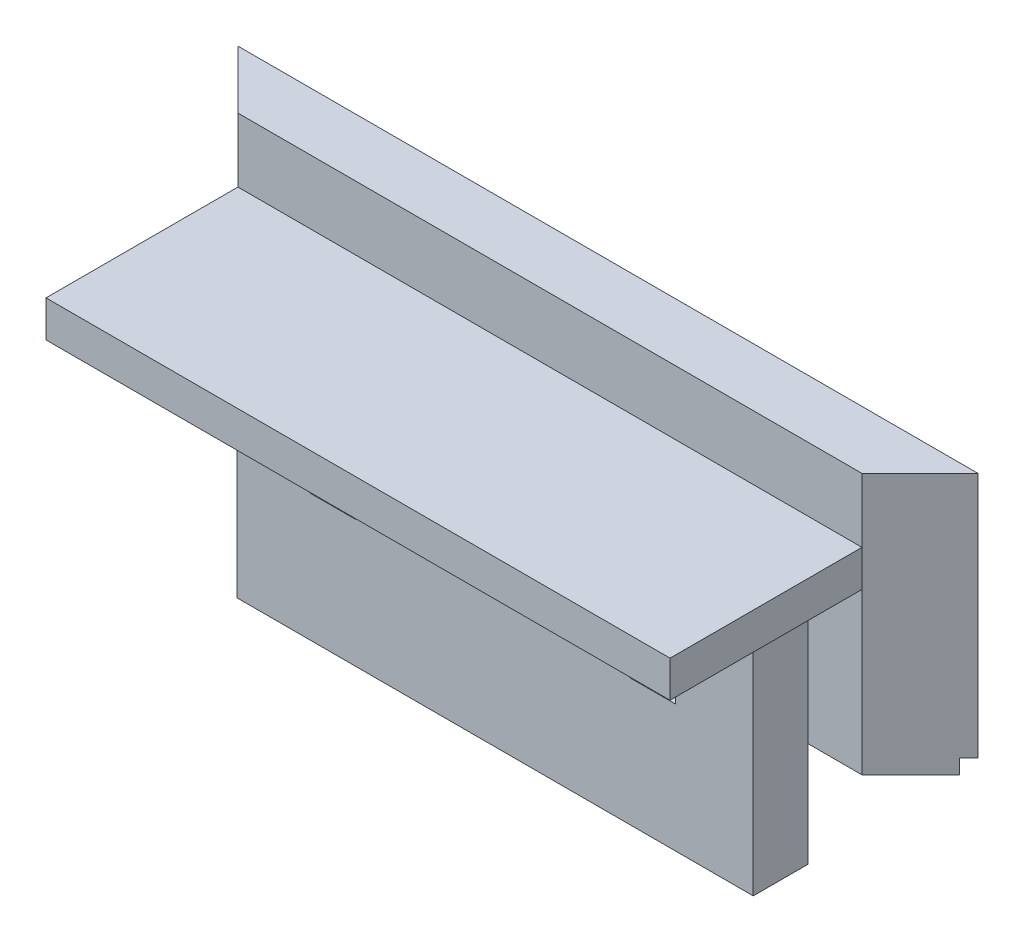
ISO-10303-21;
HEADER;
FILE_DESCRIPTION(('STEP AP214'),'2;1');
FILE_NAME('part.step','',(''),(''),'','','');
FILE_SCHEMA(('AUTOMOTIVE_DESIGN { 1 0 10303 214 1 1 1 1 }'));
ENDSEC;
DATA;
#1=APPLICATION_CONTEXT('core data for automotive mechanical design processes');
#2=APPLICATION_PROTOCOL_DEFINITION('international standard','automotive_design',2000,#1);
#3=PRODUCT_CONTEXT('',#1,'mechanical');
#4=PRODUCT('Part','Part','',(#3));
#5=PRODUCT_RELATED_PRODUCT_CATEGORY('part','',(#4));
#6=PRODUCT_DEFINITION_FORMATION('','',#4);
#7=PRODUCT_DEFINITION_CONTEXT('part definition',#1,'design');
#8=PRODUCT_DEFINITION('design','',#6,#7);
#9=PRODUCT_DEFINITION_SHAPE('','',#8);
#10=(LENGTH_UNIT() NAMED_UNIT(*) SI_UNIT(.MILLI.,.METRE.));
#11=(NAMED_UNIT(*) PLANE_ANGLE_UNIT() SI_UNIT($,.RADIAN.));
#12=(NAMED_UNIT(*) SI_UNIT($,.STERADIAN.) SOLID_ANGLE_UNIT());
#13=UNCERTAINTY_MEASURE_WITH_UNIT(LENGTH_MEASURE(1.E-05),#10,'distance_accuracy_value','');
#14=(GEOMETRIC_REPRESENTATION_CONTEXT(3) GLOBAL_UNCERTAINTY_ASSIGNED_CONTEXT((#13)) GLOBAL_UNIT_ASSIGNED_CONTEXT((#10,
#11,#12)) REPRESENTATION_CONTEXT('',''));
#15=CARTESIAN_POINT('',(0.,0.,0.));
#16=DIRECTION('',(0.,0.,1.));
#17=DIRECTION('',(1.,0.,0.));
#18=AXIS2_PLACEMENT_3D('',#15,#16,#17);
#19=CARTESIAN_POINT('',(-34.1503,28.575,6.35));
#20=DIRECTION('',(0.,0.,-1.));
#21=DIRECTION('',(-1.,0.,0.));
#22=AXIS2_PLACEMENT_3D('',#19,#20,#21);
#23=PLANE('',#22);
#24=DIRECTION('',(0.,1.,0.));
#25=VECTOR('',#24,1.);
#26=CARTESIAN_POINT('',(28.2448,-11.43,6.35));
#27=LINE('',#26,#25);
#28=CARTESIAN_POINT('',(28.2448,0.,6.35));
#29=VERTEX_POINT('',#28);
#30=CARTESIAN_POINT('',(28.2448,17.5768,6.35));
#31=VERTEX_POINT('',#30);
#32=EDGE_CURVE('E241',#29,#31,#27,.T.);
#33=ORIENTED_EDGE('',*,*,#32,.F.);
#34=DIRECTION('',(1.,0.,0.));
#35=VECTOR('',#34,1.);
#36=CARTESIAN_POINT('',(-34.1503,0.,6.35));
#37=LINE('',#36,#35);
#38=CARTESIAN_POINT('',(34.1503,0.,6.35));
#39=VERTEX_POINT('',#38);
#40=EDGE_CURVE('E419',#29,#39,#37,.T.);
#41=ORIENTED_EDGE('',*,*,#40,.T.);
#42=DIRECTION('',(0.,-1.,0.));
#43=VECTOR('',#42,1.);
#44=CARTESIAN_POINT('',(34.1503,28.575,6.35));
#45=LINE('',#44,#43);
#46=CARTESIAN_POINT('',(34.1503,17.5768,6.35));
#47=VERTEX_POINT('',#46);
#48=EDGE_CURVE('E411',#47,#39,#45,.T.);
#49=ORIENTED_EDGE('',*,*,#48,.F.);
#50=DIRECTION('',(1.,0.,0.));
#51=VECTOR('',#50,1.);
#52=CARTESIAN_POINT('',(-34.1503,17.5768,6.35));
#53=LINE('',#52,#51);
#54=EDGE_CURVE('E354',#31,#47,#53,.T.);
#55=ORIENTED_EDGE('',*,*,#54,.F.);
#56=EDGE_LOOP('',(#33,#41,#49,#55));
#57=FACE_BOUND('',#56,.T.);
#58=ADVANCED_FACE('F42',(#57),#23,.F.);
#59=DIRECTION('',(0.,-1.,0.));
#60=VECTOR('',#59,1.);
#61=CARTESIAN_POINT('',(-28.2448,-11.43,6.35));
#62=LINE('',#61,#60);
#63=CARTESIAN_POINT('',(-28.2448,17.5768,6.35));
#64=VERTEX_POINT('',#63);
#65=CARTESIAN_POINT('',(-28.2448,0.,6.35));
#66=VERTEX_POINT('',#65);
#67=EDGE_CURVE('E307',#64,#66,#62,.T.);
#68=ORIENTED_EDGE('',*,*,#67,.F.);
#69=CARTESIAN_POINT('',(-34.1503,17.5768,6.35));
#70=VERTEX_POINT('',#69);
#71=EDGE_CURVE('E355',#70,#64,#53,.T.);
#72=ORIENTED_EDGE('',*,*,#71,.F.);
#73=DIRECTION('',(0.,-1.,0.));
#74=VECTOR('',#73,1.);
#75=CARTESIAN_POINT('',(-34.1503,28.575,6.35));
#76=LINE('',#75,#74);
#77=CARTESIAN_POINT('',(-34.1503,0.,6.35));
#78=VERTEX_POINT('',#77);
#79=EDGE_CURVE('E427',#70,#78,#76,.T.);
#80=ORIENTED_EDGE('',*,*,#79,.T.);
#81=EDGE_CURVE('E402',#78,#66,#37,.T.);
#82=ORIENTED_EDGE('',*,*,#81,.T.);
#83=EDGE_LOOP('',(#68,#72,#80,#82));
#84=FACE_BOUND('',#83,.T.);
#85=ADVANCED_FACE('F456',(#84),#23,.F.);
#86=CARTESIAN_POINT('',(-34.1503,17.5768,27.3558));
#87=DIRECTION('',(0.,1.,0.));
#88=DIRECTION('',(0.,0.,1.));
#89=AXIS2_PLACEMENT_3D('',#86,#87,#88);
#90=PLANE('',#89);
#91=DIRECTION('',(0.,0.,-1.));
#92=VECTOR('',#91,1.);
#93=CARTESIAN_POINT('',(28.2448,17.5768,12.3444));
#94=LINE('',#93,#92);
#95=CARTESIAN_POINT('',(28.2448,17.5768,12.3444));
#96=VERTEX_POINT('',#95);
#97=EDGE_CURVE('E324',#96,#31,#94,.T.);
#98=ORIENTED_EDGE('',*,*,#97,.T.);
#99=ORIENTED_EDGE('',*,*,#54,.T.);
#100=DIRECTION('',(0.,0.,-1.));
#101=VECTOR('',#100,1.);
#102=CARTESIAN_POINT('',(34.1503,17.5768,27.3558));
#103=LINE('',#102,#101);
#104=CARTESIAN_POINT('',(34.1503,17.5768,27.3558));
#105=VERTEX_POINT('',#104);
#106=EDGE_CURVE('E365',#105,#47,#103,.T.);
#107=ORIENTED_EDGE('',*,*,#106,.F.);
#108=DIRECTION('',(1.,0.,0.));
#109=VECTOR('',#108,1.);
#110=CARTESIAN_POINT('',(-34.1503,17.5768,27.3558));
#111=LINE('',#110,#109);
#112=CARTESIAN_POINT('',(-34.1503,17.5768,27.3558));
#113=VERTEX_POINT('',#112);
#114=EDGE_CURVE('E340',#113,#105,#111,.T.);
#115=ORIENTED_EDGE('',*,*,#114,.F.);
#116=DIRECTION('',(0.,0.,-1.));
#117=VECTOR('',#116,1.);
#118=CARTESIAN_POINT('',(-34.1503,17.5768,27.3558));
#119=LINE('',#118,#117);
#120=EDGE_CURVE('E369',#113,#70,#119,.T.);
#121=ORIENTED_EDGE('',*,*,#120,.T.);
#122=ORIENTED_EDGE('',*,*,#71,.T.);
#123=DIRECTION('',(0.,0.,-1.));
#124=VECTOR('',#123,1.);
#125=CARTESIAN_POINT('',(-28.2448,17.5768,12.3444));
#126=LINE('',#125,#124);
#127=CARTESIAN_POINT('',(-28.2448,17.5768,12.3444));
#128=VERTEX_POINT('',#127);
#129=EDGE_CURVE('E320',#128,#64,#126,.T.);
#130=ORIENTED_EDGE('',*,*,#129,.F.);
#131=DIRECTION('',(-1.,0.,0.));
#132=VECTOR('',#131,1.);
#133=CARTESIAN_POINT('',(-28.2448,17.5768,12.3444));
#134=LINE('',#133,#132);
#135=CARTESIAN_POINT('',(-20.2438,17.5768,12.3444));
#136=VERTEX_POINT('',#135);
#137=EDGE_CURVE('E288',#136,#128,#134,.T.);
#138=ORIENTED_EDGE('',*,*,#137,.F.);
#139=DIRECTION('',(0.,0.,1.));
#140=VECTOR('',#139,1.);
#141=CARTESIAN_POINT('',(-20.2438,17.5768,6.35));
#142=LINE('',#141,#140);
#143=CARTESIAN_POINT('',(-20.2438,17.5768,6.35));
#144=VERTEX_POINT('',#143);
#145=EDGE_CURVE('E238',#144,#136,#142,.T.);
#146=ORIENTED_EDGE('',*,*,#145,.F.);
#147=DIRECTION('',(-1.,0.,0.));
#148=VECTOR('',#147,1.);
#149=CARTESIAN_POINT('',(-20.2438,17.5768,6.35));
#150=LINE('',#149,#148);
#151=CARTESIAN_POINT('',(-15.24,17.5768,6.35));
#152=VERTEX_POINT('',#151);
#153=EDGE_CURVE('E207',#152,#144,#150,.T.);
#154=ORIENTED_EDGE('',*,*,#153,.F.);
#155=DIRECTION('',(0.,0.,1.));
#156=VECTOR('',#155,1.);
#157=CARTESIAN_POINT('',(-15.24,17.5768,6.35));
#158=LINE('',#157,#156);
#159=CARTESIAN_POINT('',(-15.24,17.5768,12.3444));
#160=VERTEX_POINT('',#159);
#161=EDGE_CURVE('E242',#152,#160,#158,.T.);
#162=ORIENTED_EDGE('',*,*,#161,.T.);
#163=CARTESIAN_POINT('',(14.7574,17.5768,12.3444));
#164=VERTEX_POINT('',#163);
#165=EDGE_CURVE('E295',#164,#160,#134,.T.);
#166=ORIENTED_EDGE('',*,*,#165,.F.);
#167=DIRECTION('',(0.,0.,1.));
#168=VECTOR('',#167,1.);
#169=CARTESIAN_POINT('',(14.7574,17.5768,6.35));
#170=LINE('',#169,#168);
#171=CARTESIAN_POINT('',(14.7574,17.5768,6.35));
#172=VERTEX_POINT('',#171);
#173=EDGE_CURVE('E235',#172,#164,#170,.T.);
#174=ORIENTED_EDGE('',*,*,#173,.F.);
#175=DIRECTION('',(-1.,0.,0.));
#176=VECTOR('',#175,1.);
#177=CARTESIAN_POINT('',(14.7574,17.5768,6.35));
#178=LINE('',#177,#176);
#179=CARTESIAN_POINT('',(19.7612,17.5768,6.35));
#180=VERTEX_POINT('',#179);
#181=EDGE_CURVE('E260',#180,#172,#178,.T.);
#182=ORIENTED_EDGE('',*,*,#181,.F.);
#183=DIRECTION('',(0.,0.,1.));
#184=VECTOR('',#183,1.);
#185=CARTESIAN_POINT('',(19.7612,17.5768,6.35));
#186=LINE('',#185,#184);
#187=CARTESIAN_POINT('',(19.7612,17.5768,12.3444));
#188=VERTEX_POINT('',#187);
#189=EDGE_CURVE('E276',#180,#188,#186,.T.);
#190=ORIENTED_EDGE('',*,*,#189,.T.);
#191=EDGE_CURVE('E290',#96,#188,#134,.T.);
#192=ORIENTED_EDGE('',*,*,#191,.F.);
#193=EDGE_LOOP('',(#98,#99,#107,#115,#121,#122,#130,#138,#146,#154,#162,#166,#174,#182,#190,#192));
#194=FACE_BOUND('',#193,.T.);
#195=ADVANCED_FACE('F469',(#194),#90,.F.);
#196=DIRECTION('',(-1.,0.,0.));
#197=VECTOR('',#196,1.);
#198=CARTESIAN_POINT('',(34.1503,21.5646,6.35));
#199=LINE('',#198,#197);
#200=CARTESIAN_POINT('',(34.1503,21.5646,6.35));
#201=VERTEX_POINT('',#200);
#202=CARTESIAN_POINT('',(-34.1503,21.5646,6.35));
#203=VERTEX_POINT('',#202);
#204=EDGE_CURVE('E331',#201,#203,#199,.T.);
#205=ORIENTED_EDGE('',*,*,#204,.F.);
#206=CARTESIAN_POINT('',(34.1503,28.575,6.35));
#207=VERTEX_POINT('',#206);
#208=EDGE_CURVE('E423',#207,#201,#45,.T.);
#209=ORIENTED_EDGE('',*,*,#208,.F.);
#210=DIRECTION('',(1.,0.,0.));
#211=VECTOR('',#210,1.);
#212=CARTESIAN_POINT('',(-34.1503,28.575,6.35));
#213=LINE('',#212,#211);
#214=CARTESIAN_POINT('',(-34.1503,28.575,6.35));
#215=VERTEX_POINT('',#214);
#216=EDGE_CURVE('E408',#215,#207,#213,.T.);
#217=ORIENTED_EDGE('',*,*,#216,.F.);
#218=EDGE_CURVE('E428',#215,#203,#76,.T.);
#219=ORIENTED_EDGE('',*,*,#218,.T.);
#220=EDGE_LOOP('',(#205,#209,#217,#219));
#221=FACE_BOUND('',#220,.T.);
#222=ADVANCED_FACE('F483',(#221),#23,.F.);
#223=CARTESIAN_POINT('',(34.1503,28.575,6.35));
#224=DIRECTION('',(-0.707106781186548,0.,-0.707106781186547));
#225=DIRECTION('',(-0.707106781186547,0.,0.707106781186548));
#226=AXIS2_PLACEMENT_3D('',#223,#224,#225);
#227=PLANE('',#226);
#228=DIRECTION('',(0.707106781186547,0.,-0.707106781186548));
#229=VECTOR('',#228,1.);
#230=CARTESIAN_POINT('',(34.1503,0.,6.35));
#231=LINE('',#230,#229);
#232=CARTESIAN_POINT('',(39.49954,0.,1.00076));
#233=VERTEX_POINT('',#232);
#234=EDGE_CURVE('E396',#39,#233,#231,.T.);
#235=ORIENTED_EDGE('',*,*,#234,.T.);
#236=DIRECTION('',(0.,1.,0.));
#237=VECTOR('',#236,1.);
#238=CARTESIAN_POINT('',(39.49954,28.575,1.00076));
#239=LINE('',#238,#237);
#240=CARTESIAN_POINT('',(39.49954,1.5875,1.00076));
#241=VERTEX_POINT('',#240);
#242=EDGE_CURVE('E388',#233,#241,#239,.T.);
#243=ORIENTED_EDGE('',*,*,#242,.T.);
#244=DIRECTION('',(0.707106781186547,0.,-0.707106781186548));
#245=VECTOR('',#244,1.);
#246=CARTESIAN_POINT('',(34.1503,1.5875,6.34999999999999));
#247=LINE('',#246,#245);
#248=CARTESIAN_POINT('',(40.5003,1.5875,0.));
#249=VERTEX_POINT('',#248);
#250=EDGE_CURVE('E392',#241,#249,#247,.T.);
#251=ORIENTED_EDGE('',*,*,#250,.T.);
#252=DIRECTION('',(0.,-1.,0.));
#253=VECTOR('',#252,1.);
#254=CARTESIAN_POINT('',(40.5003,28.575,0.));
#255=LINE('',#254,#253);
#256=CARTESIAN_POINT('',(40.5003,28.575,0.));
#257=VERTEX_POINT('',#256);
#258=EDGE_CURVE('E436',#257,#249,#255,.T.);
#259=ORIENTED_EDGE('',*,*,#258,.F.);
#260=DIRECTION('',(0.707106781186547,0.,-0.707106781186548));
#261=VECTOR('',#260,1.);
#262=CARTESIAN_POINT('',(34.1503,28.575,6.35));
#263=LINE('',#262,#261);
#264=EDGE_CURVE('E397',#207,#257,#263,.T.);
#265=ORIENTED_EDGE('',*,*,#264,.F.);
#266=ORIENTED_EDGE('',*,*,#208,.T.);
#267=DIRECTION('',(0.,1.,0.));
#268=VECTOR('',#267,1.);
#269=CARTESIAN_POINT('',(34.1503,17.5768,6.35));
#270=LINE('',#269,#268);
#271=EDGE_CURVE('E337',#47,#201,#270,.T.);
#272=ORIENTED_EDGE('',*,*,#271,.F.);
#273=ORIENTED_EDGE('',*,*,#48,.T.);
#274=EDGE_LOOP('',(#235,#243,#251,#259,#265,#266,#272,#273));
#275=FACE_BOUND('',#274,.T.);
#276=ADVANCED_FACE('F44',(#275),#227,.F.);
#277=CARTESIAN_POINT('',(-40.5003,28.575,0.));
#278=DIRECTION('',(0.,0.,1.));
#279=DIRECTION('',(1.,0.,0.));
#280=AXIS2_PLACEMENT_3D('',#277,#278,#279);
#281=PLANE('',#280);
#282=ORIENTED_EDGE('',*,*,#258,.T.);
#283=DIRECTION('',(1.,0.,0.));
#284=VECTOR('',#283,1.);
#285=CARTESIAN_POINT('',(-40.5003,1.5875,0.));
#286=LINE('',#285,#284);
#287=CARTESIAN_POINT('',(-40.5003,1.5875,0.));
#288=VERTEX_POINT('',#287);
#289=EDGE_CURVE('E377',#288,#249,#286,.T.);
#290=ORIENTED_EDGE('',*,*,#289,.F.);
#291=DIRECTION('',(0.,-1.,0.));
#292=VECTOR('',#291,1.);
#293=CARTESIAN_POINT('',(-40.5003,28.575,0.));
#294=LINE('',#293,#292);
#295=CARTESIAN_POINT('',(-40.5003,28.575,0.));
#296=VERTEX_POINT('',#295);
#297=EDGE_CURVE('E432',#296,#288,#294,.T.);
#298=ORIENTED_EDGE('',*,*,#297,.F.);
#299=DIRECTION('',(-1.,0.,0.));
#300=VECTOR('',#299,1.);
#301=CARTESIAN_POINT('',(-40.5003,28.575,0.));
#302=LINE('',#301,#300);
#303=EDGE_CURVE('E401',#257,#296,#302,.T.);
#304=ORIENTED_EDGE('',*,*,#303,.F.);
#305=EDGE_LOOP('',(#282,#290,#298,#304));
#306=FACE_BOUND('',#305,.T.);
#307=ADVANCED_FACE('F567',(#306),#281,.F.);
#308=CARTESIAN_POINT('',(-40.5003,28.575,0.));
#309=DIRECTION('',(0.707106781186549,0.,-0.707106781186547));
#310=DIRECTION('',(-0.707106781186547,0.,-0.707106781186549));
#311=AXIS2_PLACEMENT_3D('',#308,#309,#310);
#312=PLANE('',#311);
#313=DIRECTION('',(0.707106781186547,0.,0.707106781186549));
#314=VECTOR('',#313,1.);
#315=CARTESIAN_POINT('',(-40.5003,1.5875,0.));
#316=LINE('',#315,#314);
#317=CARTESIAN_POINT('',(-39.49954,1.5875,1.00076));
#318=VERTEX_POINT('',#317);
#319=EDGE_CURVE('E11',#288,#318,#316,.T.);
#320=ORIENTED_EDGE('',*,*,#319,.T.);
#321=DIRECTION('',(0.,-1.,0.));
#322=VECTOR('',#321,1.);
#323=CARTESIAN_POINT('',(-39.49954,28.575,1.00076));
#324=LINE('',#323,#322);
#325=CARTESIAN_POINT('',(-39.49954,0.,1.00076));
#326=VERTEX_POINT('',#325);
#327=EDGE_CURVE('E382',#318,#326,#324,.T.);
#328=ORIENTED_EDGE('',*,*,#327,.T.);
#329=DIRECTION('',(0.707106781186546,0.,0.707106781186549));
#330=VECTOR('',#329,1.);
#331=CARTESIAN_POINT('',(-40.5003,0.,0.));
#332=LINE('',#331,#330);
#333=EDGE_CURVE('E415',#326,#78,#332,.T.);
#334=ORIENTED_EDGE('',*,*,#333,.T.);
#335=ORIENTED_EDGE('',*,*,#79,.F.);
#336=DIRECTION('',(0.,-1.,0.));
#337=VECTOR('',#336,1.);
#338=CARTESIAN_POINT('',(-34.1503,21.5646,6.35));
#339=LINE('',#338,#337);
#340=EDGE_CURVE('E350',#203,#70,#339,.T.);
#341=ORIENTED_EDGE('',*,*,#340,.F.);
#342=ORIENTED_EDGE('',*,*,#218,.F.);
#343=DIRECTION('',(0.707106781186546,0.,0.707106781186549));
#344=VECTOR('',#343,1.);
#345=CARTESIAN_POINT('',(-40.5003,28.575,0.));
#346=LINE('',#345,#344);
#347=EDGE_CURVE('E405',#296,#215,#346,.T.);
#348=ORIENTED_EDGE('',*,*,#347,.F.);
#349=ORIENTED_EDGE('',*,*,#297,.T.);
#350=EDGE_LOOP('',(#320,#328,#334,#335,#341,#342,#348,#349));
#351=FACE_BOUND('',#350,.T.);
#352=ADVANCED_FACE('F449',(#351),#312,.F.);
#353=CARTESIAN_POINT('',(0.,28.575,0.));
#354=DIRECTION('',(0.,-1.,0.));
#355=DIRECTION('',(0.,0.,-1.));
#356=AXIS2_PLACEMENT_3D('',#353,#354,#355);
#357=PLANE('',#356);
#358=ORIENTED_EDGE('',*,*,#264,.T.);
#359=ORIENTED_EDGE('',*,*,#303,.T.);
#360=ORIENTED_EDGE('',*,*,#347,.T.);
#361=ORIENTED_EDGE('',*,*,#216,.T.);
#362=EDGE_LOOP('',(#358,#359,#360,#361));
#363=FACE_BOUND('',#362,.T.);
#364=ADVANCED_FACE('F571',(#363),#357,.F.);
#365=CARTESIAN_POINT('',(0.,0.,0.));
#366=DIRECTION('',(0.,-1.,0.));
#367=DIRECTION('',(0.,0.,-1.));
#368=AXIS2_PLACEMENT_3D('',#365,#366,#367);
#369=PLANE('',#368);
#370=DIRECTION('',(-1.,0.,0.));
#371=VECTOR('',#370,1.);
#372=CARTESIAN_POINT('',(0.,0.,1.00076));
#373=LINE('',#372,#371);
#374=EDGE_CURVE('E51',#233,#326,#373,.T.);
#375=ORIENTED_EDGE('',*,*,#374,.F.);
#376=ORIENTED_EDGE('',*,*,#234,.F.);
#377=ORIENTED_EDGE('',*,*,#40,.F.);
#378=DIRECTION('',(1.,0.,0.));
#379=VECTOR('',#378,1.);
#380=CARTESIAN_POINT('',(0.,0.,6.35));
#381=LINE('',#380,#379);
#382=EDGE_CURVE('E327',#66,#29,#381,.T.);
#383=ORIENTED_EDGE('',*,*,#382,.F.);
#384=ORIENTED_EDGE('',*,*,#81,.F.);
#385=ORIENTED_EDGE('',*,*,#333,.F.);
#386=EDGE_LOOP('',(#375,#376,#377,#383,#384,#385));
#387=FACE_BOUND('',#386,.T.);
#388=ADVANCED_FACE('F452',(#387),#369,.T.);
#389=CARTESIAN_POINT('',(-40.5003,1.5875,0.));
#390=DIRECTION('',(0.,1.,0.));
#391=DIRECTION('',(0.,0.,1.));
#392=AXIS2_PLACEMENT_3D('',#389,#390,#391);
#393=PLANE('',#392);
#394=DIRECTION('',(1.,0.,0.));
#395=VECTOR('',#394,1.);
#396=CARTESIAN_POINT('',(-40.5003,1.5875,1.00076));
#397=LINE('',#396,#395);
#398=EDGE_CURVE('E378',#318,#241,#397,.T.);
#399=ORIENTED_EDGE('',*,*,#398,.F.);
#400=ORIENTED_EDGE('',*,*,#319,.F.);
#401=ORIENTED_EDGE('',*,*,#289,.T.);
#402=ORIENTED_EDGE('',*,*,#250,.F.);
#403=EDGE_LOOP('',(#399,#400,#401,#402));
#404=FACE_BOUND('',#403,.T.);
#405=ADVANCED_FACE('F578',(#404),#393,.F.);
#406=CARTESIAN_POINT('',(-40.5003,1.5875,1.00076));
#407=DIRECTION('',(0.,0.,1.));
#408=DIRECTION('',(0.,-1.,0.));
#409=AXIS2_PLACEMENT_3D('',#406,#407,#408);
#410=PLANE('',#409);
#411=ORIENTED_EDGE('',*,*,#374,.T.);
#412=ORIENTED_EDGE('',*,*,#327,.F.);
#413=ORIENTED_EDGE('',*,*,#398,.T.);
#414=ORIENTED_EDGE('',*,*,#242,.F.);
#415=EDGE_LOOP('',(#411,#412,#413,#414));
#416=FACE_BOUND('',#415,.T.);
#417=ADVANCED_FACE('F443',(#416),#410,.F.);
#418=CARTESIAN_POINT('',(34.1503,21.5646,27.3558));
#419=DIRECTION('',(0.,-1.,0.));
#420=DIRECTION('',(1.,0.,0.));
#421=AXIS2_PLACEMENT_3D('',#418,#419,#420);
#422=PLANE('',#421);
#423=ORIENTED_EDGE('',*,*,#204,.T.);
#424=DIRECTION('',(0.,0.,-1.));
#425=VECTOR('',#424,1.);
#426=CARTESIAN_POINT('',(-34.1503,21.5646,27.3558));
#427=LINE('',#426,#425);
#428=CARTESIAN_POINT('',(-34.1503,21.5646,27.3558));
#429=VERTEX_POINT('',#428);
#430=EDGE_CURVE('E373',#429,#203,#427,.T.);
#431=ORIENTED_EDGE('',*,*,#430,.F.);
#432=DIRECTION('',(-1.,0.,0.));
#433=VECTOR('',#432,1.);
#434=CARTESIAN_POINT('',(34.1503,21.5646,27.3558));
#435=LINE('',#434,#433);
#436=CARTESIAN_POINT('',(34.1503,21.5646,27.3558));
#437=VERTEX_POINT('',#436);
#438=EDGE_CURVE('E332',#437,#429,#435,.T.);
#439=ORIENTED_EDGE('',*,*,#438,.F.);
#440=DIRECTION('',(0.,0.,-1.));
#441=VECTOR('',#440,1.);
#442=CARTESIAN_POINT('',(34.1503,21.5646,27.3558));
#443=LINE('',#442,#441);
#444=EDGE_CURVE('E346',#437,#201,#443,.T.);
#445=ORIENTED_EDGE('',*,*,#444,.T.);
#446=EDGE_LOOP('',(#423,#431,#439,#445));
#447=FACE_BOUND('',#446,.T.);
#448=ADVANCED_FACE('F479',(#447),#422,.F.);
#449=CARTESIAN_POINT('',(-34.1503,21.5646,27.3558));
#450=DIRECTION('',(1.,0.,0.));
#451=DIRECTION('',(0.,0.,-1.));
#452=AXIS2_PLACEMENT_3D('',#449,#450,#451);
#453=PLANE('',#452);
#454=ORIENTED_EDGE('',*,*,#340,.T.);
#455=ORIENTED_EDGE('',*,*,#120,.F.);
#456=DIRECTION('',(0.,-1.,0.));
#457=VECTOR('',#456,1.);
#458=CARTESIAN_POINT('',(-34.1503,21.5646,27.3558));
#459=LINE('',#458,#457);
#460=EDGE_CURVE('E336',#429,#113,#459,.T.);
#461=ORIENTED_EDGE('',*,*,#460,.F.);
#462=ORIENTED_EDGE('',*,*,#430,.T.);
#463=EDGE_LOOP('',(#454,#455,#461,#462));
#464=FACE_BOUND('',#463,.T.);
#465=ADVANCED_FACE('F475',(#464),#453,.F.);
#466=CARTESIAN_POINT('',(34.1503,17.5768,27.3558));
#467=DIRECTION('',(-1.,0.,0.));
#468=DIRECTION('',(0.,0.,1.));
#469=AXIS2_PLACEMENT_3D('',#466,#467,#468);
#470=PLANE('',#469);
#471=ORIENTED_EDGE('',*,*,#271,.T.);
#472=ORIENTED_EDGE('',*,*,#444,.F.);
#473=DIRECTION('',(0.,1.,0.));
#474=VECTOR('',#473,1.);
#475=CARTESIAN_POINT('',(34.1503,17.5768,27.3558));
#476=LINE('',#475,#474);
#477=EDGE_CURVE('E343',#105,#437,#476,.T.);
#478=ORIENTED_EDGE('',*,*,#477,.F.);
#479=ORIENTED_EDGE('',*,*,#106,.T.);
#480=EDGE_LOOP('',(#471,#472,#478,#479));
#481=FACE_BOUND('',#480,.T.);
#482=ADVANCED_FACE('F492',(#481),#470,.F.);
#483=CARTESIAN_POINT('',(0.,0.,27.3558));
#484=DIRECTION('',(0.,0.,1.));
#485=DIRECTION('',(1.,0.,0.));
#486=AXIS2_PLACEMENT_3D('',#483,#484,#485);
#487=PLANE('',#486);
#488=ORIENTED_EDGE('',*,*,#438,.T.);
#489=ORIENTED_EDGE('',*,*,#460,.T.);
#490=ORIENTED_EDGE('',*,*,#114,.T.);
#491=ORIENTED_EDGE('',*,*,#477,.T.);
#492=EDGE_LOOP('',(#488,#489,#490,#491));
#493=FACE_BOUND('',#492,.T.);
#494=ADVANCED_FACE('F626',(#493),#487,.T.);
#495=CARTESIAN_POINT('',(28.2448,-11.43,12.3444));
#496=DIRECTION('',(-1.,0.,0.));
#497=DIRECTION('',(0.,0.,1.));
#498=AXIS2_PLACEMENT_3D('',#495,#496,#497);
#499=PLANE('',#498);
#500=CARTESIAN_POINT('',(28.2448,-11.43,6.35));
#501=VERTEX_POINT('',#500);
#502=EDGE_CURVE('E302',#501,#29,#27,.T.);
#503=ORIENTED_EDGE('',*,*,#502,.T.);
#504=ORIENTED_EDGE('',*,*,#32,.T.);
#505=ORIENTED_EDGE('',*,*,#97,.F.);
#506=DIRECTION('',(0.,1.,0.));
#507=VECTOR('',#506,1.);
#508=CARTESIAN_POINT('',(28.2448,-11.43,12.3444));
#509=LINE('',#508,#507);
#510=CARTESIAN_POINT('',(28.2448,-11.43,12.3444));
#511=VERTEX_POINT('',#510);
#512=EDGE_CURVE('E284',#511,#96,#509,.T.);
#513=ORIENTED_EDGE('',*,*,#512,.F.);
#514=DIRECTION('',(0.,0.,-1.));
#515=VECTOR('',#514,1.);
#516=CARTESIAN_POINT('',(28.2448,-11.43,12.3444));
#517=LINE('',#516,#515);
#518=EDGE_CURVE('E301',#511,#501,#517,.T.);
#519=ORIENTED_EDGE('',*,*,#518,.T.);
#520=EDGE_LOOP('',(#503,#504,#505,#513,#519));
#521=FACE_BOUND('',#520,.T.);
#522=ADVANCED_FACE('F532',(#521),#499,.F.);
#523=CARTESIAN_POINT('',(-28.2448,-11.43,12.3444));
#524=DIRECTION('',(1.,0.,0.));
#525=DIRECTION('',(0.,0.,-1.));
#526=AXIS2_PLACEMENT_3D('',#523,#524,#525);
#527=PLANE('',#526);
#528=ORIENTED_EDGE('',*,*,#67,.T.);
#529=CARTESIAN_POINT('',(-28.2448,-11.43,6.35));
#530=VERTEX_POINT('',#529);
#531=EDGE_CURVE('E306',#66,#530,#62,.T.);
#532=ORIENTED_EDGE('',*,*,#531,.T.);
#533=DIRECTION('',(0.,0.,-1.));
#534=VECTOR('',#533,1.);
#535=CARTESIAN_POINT('',(-28.2448,-11.43,12.3444));
#536=LINE('',#535,#534);
#537=CARTESIAN_POINT('',(-28.2448,-11.43,12.3444));
#538=VERTEX_POINT('',#537);
#539=EDGE_CURVE('E316',#538,#530,#536,.T.);
#540=ORIENTED_EDGE('',*,*,#539,.F.);
#541=DIRECTION('',(0.,-1.,0.));
#542=VECTOR('',#541,1.);
#543=CARTESIAN_POINT('',(-28.2448,-11.43,12.3444));
#544=LINE('',#543,#542);
#545=EDGE_CURVE('E294',#128,#538,#544,.T.);
#546=ORIENTED_EDGE('',*,*,#545,.F.);
#547=ORIENTED_EDGE('',*,*,#129,.T.);
#548=EDGE_LOOP('',(#528,#532,#540,#546,#547));
#549=FACE_BOUND('',#548,.T.);
#550=ADVANCED_FACE('F464',(#549),#527,.F.);
#551=CARTESIAN_POINT('',(-28.2448,-11.43,12.3444));
#552=DIRECTION('',(0.,1.,0.));
#553=DIRECTION('',(0.,0.,1.));
#554=AXIS2_PLACEMENT_3D('',#551,#552,#553);
#555=PLANE('',#554);
#556=DIRECTION('',(1.,0.,0.));
#557=VECTOR('',#556,1.);
#558=CARTESIAN_POINT('',(-28.2448,-11.43,6.35));
#559=LINE('',#558,#557);
#560=EDGE_CURVE('E289',#530,#501,#559,.T.);
#561=ORIENTED_EDGE('',*,*,#560,.T.);
#562=ORIENTED_EDGE('',*,*,#518,.F.);
#563=DIRECTION('',(1.,0.,0.));
#564=VECTOR('',#563,1.);
#565=CARTESIAN_POINT('',(-28.2448,-11.43,12.3444));
#566=LINE('',#565,#564);
#567=EDGE_CURVE('E298',#538,#511,#566,.T.);
#568=ORIENTED_EDGE('',*,*,#567,.F.);
#569=ORIENTED_EDGE('',*,*,#539,.T.);
#570=EDGE_LOOP('',(#561,#562,#568,#569));
#571=FACE_BOUND('',#570,.T.);
#572=ADVANCED_FACE('F644',(#571),#555,.F.);
#573=CARTESIAN_POINT('',(0.,0.,12.3444));
#574=DIRECTION('',(0.,0.,-1.));
#575=DIRECTION('',(-1.,0.,0.));
#576=AXIS2_PLACEMENT_3D('',#573,#574,#575);
#577=PLANE('',#576);
#578=DIRECTION('',(1.,0.,0.));
#579=VECTOR('',#578,1.);
#580=CARTESIAN_POINT('',(-20.2438,2.49936,12.3444));
#581=LINE('',#580,#579);
#582=CARTESIAN_POINT('',(-20.2438,2.49936,12.3444));
#583=VERTEX_POINT('',#582);
#584=CARTESIAN_POINT('',(-15.24,2.49936,12.3444));
#585=VERTEX_POINT('',#584);
#586=EDGE_CURVE('E226',#583,#585,#581,.T.);
#587=ORIENTED_EDGE('',*,*,#586,.F.);
#588=DIRECTION('',(0.,-1.,0.));
#589=VECTOR('',#588,1.);
#590=CARTESIAN_POINT('',(-20.2438,17.5768,12.3444));
#591=LINE('',#590,#589);
#592=EDGE_CURVE('E58',#136,#583,#591,.T.);
#593=ORIENTED_EDGE('',*,*,#592,.F.);
#594=ORIENTED_EDGE('',*,*,#137,.T.);
#595=ORIENTED_EDGE('',*,*,#545,.T.);
#596=ORIENTED_EDGE('',*,*,#567,.T.);
#597=ORIENTED_EDGE('',*,*,#512,.T.);
#598=ORIENTED_EDGE('',*,*,#191,.T.);
#599=DIRECTION('',(0.,1.,0.));
#600=VECTOR('',#599,1.);
#601=CARTESIAN_POINT('',(19.7612,17.5768,12.3444));
#602=LINE('',#601,#600);
#603=CARTESIAN_POINT('',(19.7612,2.49936,12.3444));
#604=VERTEX_POINT('',#603);
#605=EDGE_CURVE('E252',#604,#188,#602,.T.);
#606=ORIENTED_EDGE('',*,*,#605,.F.);
#607=DIRECTION('',(1.,0.,0.));
#608=VECTOR('',#607,1.);
#609=CARTESIAN_POINT('',(14.7574,2.49936,12.3444));
#610=LINE('',#609,#608);
#611=CARTESIAN_POINT('',(14.7574,2.49936,12.3444));
#612=VERTEX_POINT('',#611);
#613=EDGE_CURVE('E267',#612,#604,#610,.T.);
#614=ORIENTED_EDGE('',*,*,#613,.F.);
#615=DIRECTION('',(0.,-1.,0.));
#616=VECTOR('',#615,1.);
#617=CARTESIAN_POINT('',(14.7574,17.5768,12.3444));
#618=LINE('',#617,#616);
#619=EDGE_CURVE('E66',#164,#612,#618,.T.);
#620=ORIENTED_EDGE('',*,*,#619,.F.);
#621=ORIENTED_EDGE('',*,*,#165,.T.);
#622=DIRECTION('',(0.,1.,0.));
#623=VECTOR('',#622,1.);
#624=CARTESIAN_POINT('',(-15.24,17.5768,12.3444));
#625=LINE('',#624,#623);
#626=EDGE_CURVE('E221',#585,#160,#625,.T.);
#627=ORIENTED_EDGE('',*,*,#626,.F.);
#628=EDGE_LOOP('',(#587,#593,#594,#595,#596,#597,#598,#606,#614,#620,#621,#627));
#629=FACE_BOUND('',#628,.T.);
#630=ADVANCED_FACE('F651',(#629),#577,.F.);
#631=CARTESIAN_POINT('',(0.,0.,6.35));
#632=DIRECTION('',(0.,0.,-1.));
#633=DIRECTION('',(-1.,0.,0.));
#634=AXIS2_PLACEMENT_3D('',#631,#632,#633);
#635=PLANE('',#634);
#636=ORIENTED_EDGE('',*,*,#531,.F.);
#637=ORIENTED_EDGE('',*,*,#382,.T.);
#638=ORIENTED_EDGE('',*,*,#502,.F.);
#639=ORIENTED_EDGE('',*,*,#560,.F.);
#640=EDGE_LOOP('',(#636,#637,#638,#639));
#641=FACE_BOUND('',#640,.T.);
#642=ADVANCED_FACE('F459',(#641),#635,.T.);
#643=CARTESIAN_POINT('',(14.7574,17.5768,6.35));
#644=DIRECTION('',(-1.,0.,0.));
#645=DIRECTION('',(0.,-1.,0.));
#646=AXIS2_PLACEMENT_3D('',#643,#644,#645);
#647=PLANE('',#646);
#648=ORIENTED_EDGE('',*,*,#619,.T.);
#649=DIRECTION('',(0.,0.,1.));
#650=VECTOR('',#649,1.);
#651=CARTESIAN_POINT('',(14.7574,2.49936,6.35));
#652=LINE('',#651,#650);
#653=CARTESIAN_POINT('',(14.7574,2.49936,6.35));
#654=VERTEX_POINT('',#653);
#655=EDGE_CURVE('E264',#654,#612,#652,.T.);
#656=ORIENTED_EDGE('',*,*,#655,.F.);
#657=DIRECTION('',(0.,-1.,0.));
#658=VECTOR('',#657,1.);
#659=CARTESIAN_POINT('',(14.7574,17.5768,6.35));
#660=LINE('',#659,#658);
#661=EDGE_CURVE('E247',#172,#654,#660,.T.);
#662=ORIENTED_EDGE('',*,*,#661,.F.);
#663=ORIENTED_EDGE('',*,*,#173,.T.);
#664=EDGE_LOOP('',(#648,#656,#662,#663));
#665=FACE_BOUND('',#664,.T.);
#666=ADVANCED_FACE('F666',(#665),#647,.F.);
#667=CARTESIAN_POINT('',(19.7612,17.5768,6.35));
#668=DIRECTION('',(1.,0.,0.));
#669=DIRECTION('',(0.,1.,0.));
#670=AXIS2_PLACEMENT_3D('',#667,#668,#669);
#671=PLANE('',#670);
#672=ORIENTED_EDGE('',*,*,#605,.T.);
#673=ORIENTED_EDGE('',*,*,#189,.F.);
#674=DIRECTION('',(0.,1.,0.));
#675=VECTOR('',#674,1.);
#676=CARTESIAN_POINT('',(19.7612,17.5768,6.35));
#677=LINE('',#676,#675);
#678=CARTESIAN_POINT('',(19.7612,2.49936,6.35));
#679=VERTEX_POINT('',#678);
#680=EDGE_CURVE('E256',#679,#180,#677,.T.);
#681=ORIENTED_EDGE('',*,*,#680,.F.);
#682=DIRECTION('',(0.,0.,1.));
#683=VECTOR('',#682,1.);
#684=CARTESIAN_POINT('',(19.7612,2.49936,6.35));
#685=LINE('',#684,#683);
#686=EDGE_CURVE('E279',#679,#604,#685,.T.);
#687=ORIENTED_EDGE('',*,*,#686,.T.);
#688=EDGE_LOOP('',(#672,#673,#681,#687));
#689=FACE_BOUND('',#688,.T.);
#690=ADVANCED_FACE('F673',(#689),#671,.F.);
#691=CARTESIAN_POINT('',(14.7574,2.49936,6.35));
#692=DIRECTION('',(0.,-1.,0.));
#693=DIRECTION('',(0.,0.,-1.));
#694=AXIS2_PLACEMENT_3D('',#691,#692,#693);
#695=PLANE('',#694);
#696=ORIENTED_EDGE('',*,*,#613,.T.);
#697=ORIENTED_EDGE('',*,*,#686,.F.);
#698=DIRECTION('',(1.,0.,0.));
#699=VECTOR('',#698,1.);
#700=CARTESIAN_POINT('',(14.7574,2.49936,6.35));
#701=LINE('',#700,#699);
#702=EDGE_CURVE('E251',#654,#679,#701,.T.);
#703=ORIENTED_EDGE('',*,*,#702,.F.);
#704=ORIENTED_EDGE('',*,*,#655,.T.);
#705=EDGE_LOOP('',(#696,#697,#703,#704));
#706=FACE_BOUND('',#705,.T.);
#707=ADVANCED_FACE('F680',(#706),#695,.F.);
#708=CARTESIAN_POINT('',(0.,0.,6.35));
#709=DIRECTION('',(0.,0.,1.));
#710=DIRECTION('',(1.,0.,0.));
#711=AXIS2_PLACEMENT_3D('',#708,#709,#710);
#712=PLANE('',#711);
#713=ORIENTED_EDGE('',*,*,#661,.T.);
#714=ORIENTED_EDGE('',*,*,#702,.T.);
#715=ORIENTED_EDGE('',*,*,#680,.T.);
#716=ORIENTED_EDGE('',*,*,#181,.T.);
#717=EDGE_LOOP('',(#713,#714,#715,#716));
#718=FACE_BOUND('',#717,.T.);
#719=ADVANCED_FACE('F688',(#718),#712,.T.);
#720=CARTESIAN_POINT('',(-20.2438,17.5768,6.35));
#721=DIRECTION('',(-1.,0.,0.));
#722=DIRECTION('',(0.,-1.,0.));
#723=AXIS2_PLACEMENT_3D('',#720,#721,#722);
#724=PLANE('',#723);
#725=ORIENTED_EDGE('',*,*,#592,.T.);
#726=DIRECTION('',(0.,0.,1.));
#727=VECTOR('',#726,1.);
#728=CARTESIAN_POINT('',(-20.2438,2.49936,6.35));
#729=LINE('',#728,#727);
#730=CARTESIAN_POINT('',(-20.2438,2.49936,6.35));
#731=VERTEX_POINT('',#730);
#732=EDGE_CURVE('E196',#731,#583,#729,.T.);
#733=ORIENTED_EDGE('',*,*,#732,.F.);
#734=DIRECTION('',(0.,-1.,0.));
#735=VECTOR('',#734,1.);
#736=CARTESIAN_POINT('',(-20.2438,17.5768,6.35));
#737=LINE('',#736,#735);
#738=EDGE_CURVE('E200',#144,#731,#737,.T.);
#739=ORIENTED_EDGE('',*,*,#738,.F.);
#740=ORIENTED_EDGE('',*,*,#145,.T.);
#741=EDGE_LOOP('',(#725,#733,#739,#740));
#742=FACE_BOUND('',#741,.T.);
#743=ADVANCED_FACE('F198',(#742),#724,.F.);
#744=CARTESIAN_POINT('',(-15.24,17.5768,6.35));
#745=DIRECTION('',(1.,0.,0.));
#746=DIRECTION('',(0.,1.,0.));
#747=AXIS2_PLACEMENT_3D('',#744,#745,#746);
#748=PLANE('',#747);
#749=ORIENTED_EDGE('',*,*,#626,.T.);
#750=ORIENTED_EDGE('',*,*,#161,.F.);
#751=DIRECTION('',(0.,1.,0.));
#752=VECTOR('',#751,1.);
#753=CARTESIAN_POINT('',(-15.24,17.5768,6.35));
#754=LINE('',#753,#752);
#755=CARTESIAN_POINT('',(-15.24,2.49936,6.35));
#756=VERTEX_POINT('',#755);
#757=EDGE_CURVE('E216',#756,#152,#754,.T.);
#758=ORIENTED_EDGE('',*,*,#757,.F.);
#759=DIRECTION('',(0.,0.,1.));
#760=VECTOR('',#759,1.);
#761=CARTESIAN_POINT('',(-15.24,2.49936,6.35));
#762=LINE('',#761,#760);
#763=EDGE_CURVE('E206',#756,#585,#762,.T.);
#764=ORIENTED_EDGE('',*,*,#763,.T.);
#765=EDGE_LOOP('',(#749,#750,#758,#764));
#766=FACE_BOUND('',#765,.T.);
#767=ADVANCED_FACE('F703',(#766),#748,.F.);
#768=CARTESIAN_POINT('',(-20.2438,2.49936,6.35));
#769=DIRECTION('',(0.,-1.,0.));
#770=DIRECTION('',(0.,0.,-1.));
#771=AXIS2_PLACEMENT_3D('',#768,#769,#770);
#772=PLANE('',#771);
#773=ORIENTED_EDGE('',*,*,#586,.T.);
#774=ORIENTED_EDGE('',*,*,#763,.F.);
#775=DIRECTION('',(1.,0.,0.));
#776=VECTOR('',#775,1.);
#777=CARTESIAN_POINT('',(-20.2438,2.49936,6.35));
#778=LINE('',#777,#776);
#779=EDGE_CURVE('E210',#731,#756,#778,.T.);
#780=ORIENTED_EDGE('',*,*,#779,.F.);
#781=ORIENTED_EDGE('',*,*,#732,.T.);
#782=EDGE_LOOP('',(#773,#774,#780,#781));
#783=FACE_BOUND('',#782,.T.);
#784=ADVANCED_FACE('F211',(#783),#772,.F.);
#785=CARTESIAN_POINT('',(0.,0.,6.35));
#786=DIRECTION('',(0.,0.,1.));
#787=DIRECTION('',(1.,0.,0.));
#788=AXIS2_PLACEMENT_3D('',#785,#786,#787);
#789=PLANE('',#788);
#790=ORIENTED_EDGE('',*,*,#738,.T.);
#791=ORIENTED_EDGE('',*,*,#779,.T.);
#792=ORIENTED_EDGE('',*,*,#757,.T.);
#793=ORIENTED_EDGE('',*,*,#153,.T.);
#794=EDGE_LOOP('',(#790,#791,#792,#793));
#795=FACE_BOUND('',#794,.T.);
#796=ADVANCED_FACE('F218',(#795),#789,.T.);
#797=CLOSED_SHELL('',(#58,#85,#195,#222,#276,#307,#352,#364,#388,#405,#417,#448,#465,#482,#494,
#522,#550,#572,#630,#642,#666,#690,#707,#719,#743,#767,#784,#796));
#798=MANIFOLD_SOLID_BREP('B2',#797);
#799=ADVANCED_BREP_SHAPE_REPRESENTATION('',(#18,#798),#14);
#800=SHAPE_DEFINITION_REPRESENTATION(#9,#799);
ENDSEC;
END-ISO-10303-21;
